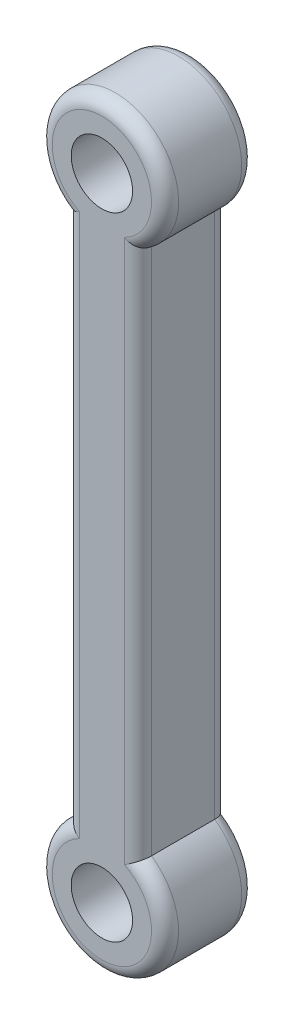
ISO-10303-21;
HEADER;
FILE_DESCRIPTION(('STEP AP214'),'2;1');
FILE_NAME('part.step','',(''),(''),'','','');
FILE_SCHEMA(('AUTOMOTIVE_DESIGN { 1 0 10303 214 1 1 1 1 }'));
ENDSEC;
DATA;
#1=APPLICATION_CONTEXT('core data for automotive mechanical design processes');
#2=APPLICATION_PROTOCOL_DEFINITION('international standard','automotive_design',2000,#1);
#3=PRODUCT_CONTEXT('',#1,'mechanical');
#4=PRODUCT('Part','Part','',(#3));
#5=PRODUCT_RELATED_PRODUCT_CATEGORY('part','',(#4));
#6=PRODUCT_DEFINITION_FORMATION('','',#4);
#7=PRODUCT_DEFINITION_CONTEXT('part definition',#1,'design');
#8=PRODUCT_DEFINITION('design','',#6,#7);
#9=PRODUCT_DEFINITION_SHAPE('','',#8);
#10=(LENGTH_UNIT() NAMED_UNIT(*) SI_UNIT(.MILLI.,.METRE.));
#11=(NAMED_UNIT(*) PLANE_ANGLE_UNIT() SI_UNIT($,.RADIAN.));
#12=(NAMED_UNIT(*) SI_UNIT($,.STERADIAN.) SOLID_ANGLE_UNIT());
#13=UNCERTAINTY_MEASURE_WITH_UNIT(LENGTH_MEASURE(1.E-05),#10,'distance_accuracy_value','');
#14=(GEOMETRIC_REPRESENTATION_CONTEXT(3) GLOBAL_UNCERTAINTY_ASSIGNED_CONTEXT((#13)) GLOBAL_UNIT_ASSIGNED_CONTEXT((#10,
#11,#12)) REPRESENTATION_CONTEXT('',''));
#15=CARTESIAN_POINT('',(0.,0.,0.));
#16=DIRECTION('',(0.,0.,1.));
#17=DIRECTION('',(1.,0.,0.));
#18=AXIS2_PLACEMENT_3D('',#15,#16,#17);
#19=CARTESIAN_POINT('',(0.,17.5,5.));
#20=DIRECTION('',(0.,0.,1.));
#21=DIRECTION('',(1.,0.,0.));
#22=AXIS2_PLACEMENT_3D('',#19,#20,#21);
#23=PLANE('',#22);
#24=CARTESIAN_POINT('',(0.,17.5,5.));
#25=DIRECTION('',(0.,0.,1.));
#26=DIRECTION('',(1.,0.,0.));
#27=AXIS2_PLACEMENT_3D('',#24,#25,#26);
#28=CIRCLE('',#27,2.75);
#29=CARTESIAN_POINT('',(1.25,15.0505102572168,5.));
#30=VERTEX_POINT('',#29);
#31=CARTESIAN_POINT('',(-1.25,15.0505102572168,5.));
#32=VERTEX_POINT('',#31);
#33=EDGE_CURVE('E65',#30,#32,#28,.T.);
#34=ORIENTED_EDGE('',*,*,#33,.T.);
#35=DIRECTION('',(0.,-1.,0.));
#36=VECTOR('',#35,1.);
#37=CARTESIAN_POINT('',(-1.25,-14.627718676731,5.));
#38=LINE('',#37,#36);
#39=CARTESIAN_POINT('',(-1.25,-15.0505102572168,5.));
#40=VERTEX_POINT('',#39);
#41=EDGE_CURVE('E11',#32,#40,#38,.T.);
#42=ORIENTED_EDGE('',*,*,#41,.T.);
#43=CARTESIAN_POINT('',(0.,-17.5,5.));
#44=DIRECTION('',(0.,0.,1.));
#45=DIRECTION('',(1.,0.,0.));
#46=AXIS2_PLACEMENT_3D('',#43,#44,#45);
#47=CIRCLE('',#46,2.75);
#48=CARTESIAN_POINT('',(1.25,-15.0505102572168,5.));
#49=VERTEX_POINT('',#48);
#50=EDGE_CURVE('E54',#40,#49,#47,.T.);
#51=ORIENTED_EDGE('',*,*,#50,.T.);
#52=DIRECTION('',(0.,1.,0.));
#53=VECTOR('',#52,1.);
#54=CARTESIAN_POINT('',(1.25,14.627718676731,5.));
#55=LINE('',#54,#53);
#56=EDGE_CURVE('E307',#49,#30,#55,.T.);
#57=ORIENTED_EDGE('',*,*,#56,.T.);
#58=EDGE_LOOP('',(#34,#42,#51,#57));
#59=FACE_BOUND('',#58,.T.);
#60=CARTESIAN_POINT('',(0.,-17.5,5.));
#61=DIRECTION('',(0.,0.,1.));
#62=DIRECTION('',(1.,0.,0.));
#63=AXIS2_PLACEMENT_3D('',#60,#61,#62);
#64=CIRCLE('',#63,1.7);
#65=CARTESIAN_POINT('',(1.7,-17.5,5.));
#66=VERTEX_POINT('',#65);
#67=EDGE_CURVE('E263',#66,#66,#64,.T.);
#68=ORIENTED_EDGE('',*,*,#67,.F.);
#69=EDGE_LOOP('',(#68));
#70=FACE_BOUND('',#69,.T.);
#71=CARTESIAN_POINT('',(0.,17.5,5.));
#72=DIRECTION('',(0.,0.,1.));
#73=DIRECTION('',(1.,0.,0.));
#74=AXIS2_PLACEMENT_3D('',#71,#72,#73);
#75=CIRCLE('',#74,1.7);
#76=CARTESIAN_POINT('',(1.69999999999999,17.5,5.));
#77=VERTEX_POINT('',#76);
#78=EDGE_CURVE('E253',#77,#77,#75,.T.);
#79=ORIENTED_EDGE('',*,*,#78,.F.);
#80=EDGE_LOOP('',(#79));
#81=FACE_BOUND('',#80,.T.);
#82=ADVANCED_FACE('F39',(#59,#70,#81),#23,.T.);
#83=CARTESIAN_POINT('',(0.,17.5,0.));
#84=DIRECTION('',(0.,0.,1.));
#85=DIRECTION('',(1.,0.,0.));
#86=AXIS2_PLACEMENT_3D('',#83,#84,#85);
#87=PLANE('',#86);
#88=DIRECTION('',(0.,-1.,0.));
#89=VECTOR('',#88,1.);
#90=CARTESIAN_POINT('',(-1.25,17.5,0.));
#91=LINE('',#90,#89);
#92=CARTESIAN_POINT('',(-1.25,-15.0505102572168,0.));
#93=VERTEX_POINT('',#92);
#94=CARTESIAN_POINT('',(-1.25,15.0505102572168,0.));
#95=VERTEX_POINT('',#94);
#96=EDGE_CURVE('E287',#93,#95,#91,.F.);
#97=ORIENTED_EDGE('',*,*,#96,.T.);
#98=CARTESIAN_POINT('',(0.,17.5,0.));
#99=DIRECTION('',(0.,0.,1.));
#100=DIRECTION('',(1.,0.,0.));
#101=AXIS2_PLACEMENT_3D('',#98,#99,#100);
#102=CIRCLE('',#101,2.75);
#103=CARTESIAN_POINT('',(1.25,15.0505102572168,0.));
#104=VERTEX_POINT('',#103);
#105=EDGE_CURVE('E122',#95,#104,#102,.F.);
#106=ORIENTED_EDGE('',*,*,#105,.T.);
#107=DIRECTION('',(0.,1.,0.));
#108=VECTOR('',#107,1.);
#109=CARTESIAN_POINT('',(1.25,17.5,0.));
#110=LINE('',#109,#108);
#111=CARTESIAN_POINT('',(1.25,-15.0505102572168,0.));
#112=VERTEX_POINT('',#111);
#113=EDGE_CURVE('E284',#104,#112,#110,.F.);
#114=ORIENTED_EDGE('',*,*,#113,.T.);
#115=CARTESIAN_POINT('',(0.,-17.5,0.));
#116=DIRECTION('',(0.,0.,1.));
#117=DIRECTION('',(1.,0.,0.));
#118=AXIS2_PLACEMENT_3D('',#115,#116,#117);
#119=CIRCLE('',#118,2.75);
#120=EDGE_CURVE('E281',#112,#93,#119,.F.);
#121=ORIENTED_EDGE('',*,*,#120,.T.);
#122=EDGE_LOOP('',(#97,#106,#114,#121));
#123=FACE_BOUND('',#122,.T.);
#124=CARTESIAN_POINT('',(0.,-17.5,0.));
#125=DIRECTION('',(0.,0.,1.));
#126=DIRECTION('',(1.,0.,0.));
#127=AXIS2_PLACEMENT_3D('',#124,#125,#126);
#128=CIRCLE('',#127,1.7);
#129=CARTESIAN_POINT('',(1.7,-17.5,0.));
#130=VERTEX_POINT('',#129);
#131=EDGE_CURVE('E260',#130,#130,#128,.T.);
#132=ORIENTED_EDGE('',*,*,#131,.T.);
#133=EDGE_LOOP('',(#132));
#134=FACE_BOUND('',#133,.T.);
#135=CARTESIAN_POINT('',(0.,17.5,0.));
#136=DIRECTION('',(0.,0.,1.));
#137=DIRECTION('',(1.,0.,0.));
#138=AXIS2_PLACEMENT_3D('',#135,#136,#137);
#139=CIRCLE('',#138,1.7);
#140=CARTESIAN_POINT('',(1.69999999999999,17.5,0.));
#141=VERTEX_POINT('',#140);
#142=EDGE_CURVE('E190',#141,#141,#139,.T.);
#143=ORIENTED_EDGE('',*,*,#142,.T.);
#144=EDGE_LOOP('',(#143));
#145=FACE_BOUND('',#144,.T.);
#146=ADVANCED_FACE('F223',(#123,#134,#145),#87,.F.);
#147=CARTESIAN_POINT('',(0.,17.5,5.));
#148=DIRECTION('',(0.,0.,-1.));
#149=DIRECTION('',(-1.,0.,0.));
#150=AXIS2_PLACEMENT_3D('',#147,#148,#149);
#151=CYLINDRICAL_SURFACE('',#150,3.5);
#152=DIRECTION('',(0.,0.,-1.));
#153=VECTOR('',#152,1.);
#154=CARTESIAN_POINT('',(2.,14.627718676731,5.));
#155=LINE('',#154,#153);
#156=CARTESIAN_POINT('',(2.,14.627718676731,4.25));
#157=VERTEX_POINT('',#156);
#158=CARTESIAN_POINT('',(2.,14.627718676731,0.75));
#159=VERTEX_POINT('',#158);
#160=EDGE_CURVE('E267',#157,#159,#155,.T.);
#161=ORIENTED_EDGE('',*,*,#160,.T.);
#162=CARTESIAN_POINT('',(0.,17.5,0.75));
#163=DIRECTION('',(0.,0.,1.));
#164=DIRECTION('',(1.,0.,0.));
#165=AXIS2_PLACEMENT_3D('',#162,#163,#164);
#166=CIRCLE('',#165,3.5);
#167=CARTESIAN_POINT('',(-2.,14.627718676731,0.75));
#168=VERTEX_POINT('',#167);
#169=EDGE_CURVE('E132',#159,#168,#166,.T.);
#170=ORIENTED_EDGE('',*,*,#169,.T.);
#171=DIRECTION('',(0.,0.,-1.));
#172=VECTOR('',#171,1.);
#173=CARTESIAN_POINT('',(-2.,14.627718676731,5.));
#174=LINE('',#173,#172);
#175=CARTESIAN_POINT('',(-2.,14.627718676731,4.25));
#176=VERTEX_POINT('',#175);
#177=EDGE_CURVE('E114',#176,#168,#174,.T.);
#178=ORIENTED_EDGE('',*,*,#177,.F.);
#179=CARTESIAN_POINT('',(0.,17.5,4.25));
#180=DIRECTION('',(0.,0.,1.));
#181=DIRECTION('',(1.,0.,0.));
#182=AXIS2_PLACEMENT_3D('',#179,#180,#181);
#183=CIRCLE('',#182,3.5);
#184=EDGE_CURVE('E129',#176,#157,#183,.F.);
#185=ORIENTED_EDGE('',*,*,#184,.T.);
#186=EDGE_LOOP('',(#161,#170,#178,#185));
#187=FACE_BOUND('',#186,.T.);
#188=ADVANCED_FACE('F128',(#187),#151,.T.);
#189=CARTESIAN_POINT('',(-2.,-14.627718676731,5.));
#190=DIRECTION('',(1.,0.,0.));
#191=DIRECTION('',(0.,0.,-1.));
#192=AXIS2_PLACEMENT_3D('',#189,#190,#191);
#193=PLANE('',#192);
#194=ORIENTED_EDGE('',*,*,#177,.T.);
#195=DIRECTION('',(0.,-1.,0.));
#196=VECTOR('',#195,1.);
#197=CARTESIAN_POINT('',(-2.,-14.627718676731,0.75));
#198=LINE('',#197,#196);
#199=CARTESIAN_POINT('',(-2.,-14.627718676731,0.75));
#200=VERTEX_POINT('',#199);
#201=EDGE_CURVE('E121',#168,#200,#198,.T.);
#202=ORIENTED_EDGE('',*,*,#201,.T.);
#203=DIRECTION('',(0.,0.,-1.));
#204=VECTOR('',#203,1.);
#205=CARTESIAN_POINT('',(-2.,-14.627718676731,5.));
#206=LINE('',#205,#204);
#207=CARTESIAN_POINT('',(-2.,-14.627718676731,4.25));
#208=VERTEX_POINT('',#207);
#209=EDGE_CURVE('E116',#208,#200,#206,.T.);
#210=ORIENTED_EDGE('',*,*,#209,.F.);
#211=DIRECTION('',(0.,-1.,0.));
#212=VECTOR('',#211,1.);
#213=CARTESIAN_POINT('',(-2.,14.627718676731,4.25));
#214=LINE('',#213,#212);
#215=EDGE_CURVE('E111',#208,#176,#214,.F.);
#216=ORIENTED_EDGE('',*,*,#215,.T.);
#217=EDGE_LOOP('',(#194,#202,#210,#216));
#218=FACE_BOUND('',#217,.T.);
#219=ADVANCED_FACE('F113',(#218),#193,.F.);
#220=CARTESIAN_POINT('',(0.,-17.5,5.));
#221=DIRECTION('',(0.,0.,-1.));
#222=DIRECTION('',(-1.,0.,0.));
#223=AXIS2_PLACEMENT_3D('',#220,#221,#222);
#224=CYLINDRICAL_SURFACE('',#223,3.5);
#225=ORIENTED_EDGE('',*,*,#209,.T.);
#226=CARTESIAN_POINT('',(0.,-17.5,0.75));
#227=DIRECTION('',(0.,0.,1.));
#228=DIRECTION('',(1.,0.,0.));
#229=AXIS2_PLACEMENT_3D('',#226,#227,#228);
#230=CIRCLE('',#229,3.5);
#231=CARTESIAN_POINT('',(2.,-14.627718676731,0.75));
#232=VERTEX_POINT('',#231);
#233=EDGE_CURVE('E304',#200,#232,#230,.T.);
#234=ORIENTED_EDGE('',*,*,#233,.T.);
#235=DIRECTION('',(0.,0.,-1.));
#236=VECTOR('',#235,1.);
#237=CARTESIAN_POINT('',(2.,-14.627718676731,5.));
#238=LINE('',#237,#236);
#239=CARTESIAN_POINT('',(2.,-14.627718676731,4.25));
#240=VERTEX_POINT('',#239);
#241=EDGE_CURVE('E273',#240,#232,#238,.T.);
#242=ORIENTED_EDGE('',*,*,#241,.F.);
#243=CARTESIAN_POINT('',(0.,-17.5,4.25));
#244=DIRECTION('',(0.,0.,1.));
#245=DIRECTION('',(1.,0.,0.));
#246=AXIS2_PLACEMENT_3D('',#243,#244,#245);
#247=CIRCLE('',#246,3.5);
#248=EDGE_CURVE('E301',#240,#208,#247,.F.);
#249=ORIENTED_EDGE('',*,*,#248,.T.);
#250=EDGE_LOOP('',(#225,#234,#242,#249));
#251=FACE_BOUND('',#250,.T.);
#252=ADVANCED_FACE('F226',(#251),#224,.T.);
#253=CARTESIAN_POINT('',(2.,-14.627718676731,5.));
#254=DIRECTION('',(-1.,0.,0.));
#255=DIRECTION('',(0.,0.,1.));
#256=AXIS2_PLACEMENT_3D('',#253,#254,#255);
#257=PLANE('',#256);
#258=ORIENTED_EDGE('',*,*,#241,.T.);
#259=DIRECTION('',(0.,1.,0.));
#260=VECTOR('',#259,1.);
#261=CARTESIAN_POINT('',(2.,-14.627718676731,0.75));
#262=LINE('',#261,#260);
#263=EDGE_CURVE('E298',#232,#159,#262,.T.);
#264=ORIENTED_EDGE('',*,*,#263,.T.);
#265=ORIENTED_EDGE('',*,*,#160,.F.);
#266=DIRECTION('',(0.,1.,0.));
#267=VECTOR('',#266,1.);
#268=CARTESIAN_POINT('',(2.,-14.627718676731,4.25));
#269=LINE('',#268,#267);
#270=EDGE_CURVE('E295',#157,#240,#269,.F.);
#271=ORIENTED_EDGE('',*,*,#270,.T.);
#272=EDGE_LOOP('',(#258,#264,#265,#271));
#273=FACE_BOUND('',#272,.T.);
#274=ADVANCED_FACE('F229',(#273),#257,.F.);
#275=CARTESIAN_POINT('',(0.,-17.5,5.));
#276=DIRECTION('',(0.,0.,-1.));
#277=DIRECTION('',(-1.,0.,0.));
#278=AXIS2_PLACEMENT_3D('',#275,#276,#277);
#279=CYLINDRICAL_SURFACE('',#278,1.7);
#280=ORIENTED_EDGE('',*,*,#67,.T.);
#281=EDGE_LOOP('',(#280));
#282=FACE_BOUND('',#281,.T.);
#283=ORIENTED_EDGE('',*,*,#131,.F.);
#284=EDGE_LOOP('',(#283));
#285=FACE_BOUND('',#284,.T.);
#286=ADVANCED_FACE('F233',(#282,#285),#279,.F.);
#287=CARTESIAN_POINT('',(0.,17.5,5.));
#288=DIRECTION('',(0.,0.,-1.));
#289=DIRECTION('',(-1.,0.,0.));
#290=AXIS2_PLACEMENT_3D('',#287,#288,#289);
#291=CYLINDRICAL_SURFACE('',#290,1.7);
#292=ORIENTED_EDGE('',*,*,#78,.T.);
#293=EDGE_LOOP('',(#292));
#294=FACE_BOUND('',#293,.T.);
#295=ORIENTED_EDGE('',*,*,#142,.F.);
#296=EDGE_LOOP('',(#295));
#297=FACE_BOUND('',#296,.T.);
#298=ADVANCED_FACE('F242',(#294,#297),#291,.F.);
#299=CARTESIAN_POINT('',(0.,-17.5,0.75));
#300=DIRECTION('',(0.,0.,1.));
#301=DIRECTION('',(1.,0.,0.));
#302=AXIS2_PLACEMENT_3D('',#299,#300,#301);
#303=TOROIDAL_SURFACE('',#302,2.75,0.75);
#304=CARTESIAN_POINT('',(-2.,-14.627718676731,0.75));
#305=CARTESIAN_POINT('',(-2.00000095325139,-14.6277184380373,0.730675526344664));
#306=CARTESIAN_POINT('',(-1.9992525688487,-14.6281089826292,0.711360936222173));
#307=CARTESIAN_POINT('',(-1.99627424982253,-14.6296648887274,0.672882704881055));
#308=CARTESIAN_POINT('',(-1.99404470038907,-14.6308300487882,0.65371902572743));
#309=CARTESIAN_POINT('',(-1.9851853415741,-14.6354640650265,0.596802648427952));
#310=CARTESIAN_POINT('',(-1.97638447728872,-14.6400716010906,0.55945312347999));
#311=CARTESIAN_POINT('',(-1.95340221103497,-14.6521512369574,0.486994207855817));
#312=CARTESIAN_POINT('',(-1.9392236720455,-14.6596218125506,0.451883636798332));
#313=CARTESIAN_POINT('',(-1.90608780115928,-14.6771751313508,0.384688114777172));
#314=CARTESIAN_POINT('',(-1.88712766361704,-14.6872594082671,0.352604955415009));
#315=CARTESIAN_POINT('',(-1.84429220721255,-14.7101947947676,0.290886192530706));
#316=CARTESIAN_POINT('',(-1.82024732758605,-14.7231423410526,0.261404735108066));
#317=CARTESIAN_POINT('',(-1.76861818996254,-14.7511728049644,0.206911260304124));
#318=CARTESIAN_POINT('',(-1.74103304512401,-14.7662562577371,0.18190036657455));
#319=CARTESIAN_POINT('',(-1.68006819436873,-14.7999043802964,0.134212940683131));
#320=CARTESIAN_POINT('',(-1.64638422956725,-14.8186686626426,0.112067097720292));
#321=CARTESIAN_POINT('',(-1.57670265513905,-14.8579375600058,0.073723877566145));
#322=CARTESIAN_POINT('',(-1.54070289395295,-14.8784437992777,0.0575321287942939));
#323=CARTESIAN_POINT('',(-1.46344331662629,-14.9230100379807,0.0297209935896172));
#324=CARTESIAN_POINT('',(-1.42202995025201,-14.9472164873707,0.0187665914594678));
#325=CARTESIAN_POINT('',(-1.33865282455477,-14.9966885122841,0.00405890903843842));
#326=CARTESIAN_POINT('',(-1.29669025481339,-15.0219519973025,0.000292043517131759));
#327=CARTESIAN_POINT('',(-1.25329968550071,-15.0484902410092,5.43429847304771E-06));
#328=CARTESIAN_POINT('',(-1.25164965235718,-15.0495000505079,-9.07586938193818E-09));
#329=CARTESIAN_POINT('',(-1.25,-15.0505102572168,0.));
#330=B_SPLINE_CURVE_WITH_KNOTS('',3,(#304,#305,#306,#307,#308,#309,#310,#311,#312,#313,#314,
#315,#316,#317,#318,#319,#320,#321,#322,#323,#324,#325,#326,#327,#328,#329),.UNSPECIFIED.,.F.,
.F.,(4,2,2,2,2,2,2,2,2,2,2,2,4),(0.,0.0579356663711786,0.115856271956782,0.231189950300505,
0.346462313024938,0.461802470843834,0.581868497571108,0.701964659931731,0.834825964767603,
0.96781254279977,1.11486883078254,1.26164688989136,1.26745040204934),.UNSPECIFIED.);
#331=EDGE_CURVE('E191',#93,#200,#330,.F.);
#332=ORIENTED_EDGE('',*,*,#331,.F.);
#333=ORIENTED_EDGE('',*,*,#120,.F.);
#334=CARTESIAN_POINT('',(2.,-14.627718676731,0.75));
#335=CARTESIAN_POINT('',(2.00000095325139,-14.6277184380373,0.730675526344664));
#336=CARTESIAN_POINT('',(1.9992525688487,-14.6281089826292,0.711360936222173));
#337=CARTESIAN_POINT('',(1.99627424982253,-14.6296648887274,0.672882704881056));
#338=CARTESIAN_POINT('',(1.99404470038907,-14.6308300487882,0.65371902572743));
#339=CARTESIAN_POINT('',(1.9851853415741,-14.6354640650265,0.596802648427952));
#340=CARTESIAN_POINT('',(1.97638447728872,-14.6400716010906,0.559453123479991));
#341=CARTESIAN_POINT('',(1.95340221103497,-14.6521512369574,0.486994207855817));
#342=CARTESIAN_POINT('',(1.9392236720455,-14.6596218125506,0.451883636798333));
#343=CARTESIAN_POINT('',(1.90608780115928,-14.6771751313508,0.384688114777172));
#344=CARTESIAN_POINT('',(1.88712766361704,-14.6872594082671,0.352604955415009));
#345=CARTESIAN_POINT('',(1.84429220721255,-14.7101947947676,0.290886192530706));
#346=CARTESIAN_POINT('',(1.82024732758605,-14.7231423410526,0.261404735108067));
#347=CARTESIAN_POINT('',(1.76861818996254,-14.7511728049644,0.206911260304125));
#348=CARTESIAN_POINT('',(1.74103304512401,-14.7662562577371,0.181900366574551));
#349=CARTESIAN_POINT('',(1.68006819436873,-14.7999043802964,0.134212940683132));
#350=CARTESIAN_POINT('',(1.64638422956725,-14.8186686626426,0.112067097720293));
#351=CARTESIAN_POINT('',(1.57670265513905,-14.8579375600058,0.0737238775661453));
#352=CARTESIAN_POINT('',(1.54070289395296,-14.8784437992777,0.0575321287942943));
#353=CARTESIAN_POINT('',(1.46344331662629,-14.9230100379806,0.0297209935896177));
#354=CARTESIAN_POINT('',(1.42202995025202,-14.9472164873707,0.0187665914594682));
#355=CARTESIAN_POINT('',(1.33865282455477,-14.9966885122841,0.0040589090384384));
#356=CARTESIAN_POINT('',(1.29669025481338,-15.0219519973025,0.000292043517131481));
#357=CARTESIAN_POINT('',(1.25329968550071,-15.0484902410092,5.43429847302378E-06));
#358=CARTESIAN_POINT('',(1.25164965235718,-15.0495000505079,-9.07586939531536E-09));
#359=CARTESIAN_POINT('',(1.25,-15.0505102572168,0.));
#360=B_SPLINE_CURVE_WITH_KNOTS('',3,(#334,#335,#336,#337,#338,#339,#340,#341,#342,#343,#344,
#345,#346,#347,#348,#349,#350,#351,#352,#353,#354,#355,#356,#357,#358,#359),.UNSPECIFIED.,.F.,
.F.,(4,2,2,2,2,2,2,2,2,2,2,2,4),(0.,0.0579356663711784,0.115856271956782,0.231189950300505,
0.346462313024938,0.461802470843834,0.581868497571108,0.701964659931731,0.834825964767601,
0.96781254279977,1.11486883078254,1.26164688989136,1.26745040204934),.UNSPECIFIED.);
#361=EDGE_CURVE('E182',#232,#112,#360,.T.);
#362=ORIENTED_EDGE('',*,*,#361,.F.);
#363=ORIENTED_EDGE('',*,*,#233,.F.);
#364=EDGE_LOOP('',(#332,#333,#362,#363));
#365=FACE_BOUND('',#364,.T.);
#366=ADVANCED_FACE('F171',(#365),#303,.T.);
#367=CARTESIAN_POINT('',(1.25,-14.627718676731,0.75));
#368=DIRECTION('',(0.,1.,0.));
#369=DIRECTION('',(0.,0.,1.));
#370=AXIS2_PLACEMENT_3D('',#367,#368,#369);
#371=CYLINDRICAL_SURFACE('',#370,0.75);
#372=ORIENTED_EDGE('',*,*,#361,.T.);
#373=ORIENTED_EDGE('',*,*,#113,.F.);
#374=CARTESIAN_POINT('',(2.,14.627718676731,0.75));
#375=CARTESIAN_POINT('',(2.00000095325139,14.6277184380373,0.730675526344664));
#376=CARTESIAN_POINT('',(1.9992525688487,14.6281089826292,0.711360936222173));
#377=CARTESIAN_POINT('',(1.99627424982253,14.6296648887274,0.672882704881055));
#378=CARTESIAN_POINT('',(1.99404470038907,14.6308300487882,0.65371902572743));
#379=CARTESIAN_POINT('',(1.9851853415741,14.6354640650265,0.596802648427952));
#380=CARTESIAN_POINT('',(1.97638447728872,14.6400716010906,0.55945312347999));
#381=CARTESIAN_POINT('',(1.95340221103497,14.6521512369574,0.486994207855817));
#382=CARTESIAN_POINT('',(1.9392236720455,14.6596218125506,0.451883636798332));
#383=CARTESIAN_POINT('',(1.90608780115928,14.6771751313508,0.384688114777172));
#384=CARTESIAN_POINT('',(1.88712766361704,14.6872594082671,0.352604955415009));
#385=CARTESIAN_POINT('',(1.84429220721255,14.7101947947676,0.290886192530706));
#386=CARTESIAN_POINT('',(1.82024732758605,14.7231423410526,0.261404735108066));
#387=CARTESIAN_POINT('',(1.76861818996254,14.7511728049644,0.206911260304124));
#388=CARTESIAN_POINT('',(1.74103304512401,14.7662562577371,0.18190036657455));
#389=CARTESIAN_POINT('',(1.68006819436873,14.7999043802964,0.134212940683132));
#390=CARTESIAN_POINT('',(1.64638422956725,14.8186686626426,0.112067097720293));
#391=CARTESIAN_POINT('',(1.57670265513904,14.8579375600058,0.073723877566145));
#392=CARTESIAN_POINT('',(1.54070289395295,14.8784437992777,0.0575321287942939));
#393=CARTESIAN_POINT('',(1.46344331662629,14.9230100379807,0.0297209935896173));
#394=CARTESIAN_POINT('',(1.42202995025203,14.9472164873708,0.018766591459468));
#395=CARTESIAN_POINT('',(1.33865282455475,14.9966885122841,0.00405890903843832));
#396=CARTESIAN_POINT('',(1.29669025481334,15.0219519973024,0.000292043517131219));
#397=CARTESIAN_POINT('',(1.2532996855007,15.0484902410092,5.43429847300519E-06));
#398=CARTESIAN_POINT('',(1.25164965235718,15.0495000505079,-9.07586940405784E-09));
#399=CARTESIAN_POINT('',(1.25,15.0505102572168,0.));
#400=B_SPLINE_CURVE_WITH_KNOTS('',3,(#374,#375,#376,#377,#378,#379,#380,#381,#382,#383,#384,
#385,#386,#387,#388,#389,#390,#391,#392,#393,#394,#395,#396,#397,#398,#399),.UNSPECIFIED.,.F.,
.F.,(4,2,2,2,2,2,2,2,2,2,2,2,4),(0.,0.0579356663711786,0.115856271956782,0.231189950300505,
0.346462313024938,0.461802470843834,0.581868497571108,0.701964659931731,0.834825964767602,
0.96781254279977,1.11486883078254,1.26164688989136,1.26745040204934),.UNSPECIFIED.);
#401=EDGE_CURVE('E147',#159,#104,#400,.T.);
#402=ORIENTED_EDGE('',*,*,#401,.F.);
#403=ORIENTED_EDGE('',*,*,#263,.F.);
#404=EDGE_LOOP('',(#372,#373,#402,#403));
#405=FACE_BOUND('',#404,.T.);
#406=ADVANCED_FACE('F198',(#405),#371,.T.);
#407=CARTESIAN_POINT('',(-1.25,-14.627718676731,0.75));
#408=DIRECTION('',(0.,-1.,0.));
#409=DIRECTION('',(0.,0.,-1.));
#410=AXIS2_PLACEMENT_3D('',#407,#408,#409);
#411=CYLINDRICAL_SURFACE('',#410,0.75);
#412=ORIENTED_EDGE('',*,*,#331,.T.);
#413=ORIENTED_EDGE('',*,*,#201,.F.);
#414=CARTESIAN_POINT('',(-2.,14.627718676731,0.75));
#415=CARTESIAN_POINT('',(-2.00000095325139,14.6277184380373,0.730675526344664));
#416=CARTESIAN_POINT('',(-1.9992525688487,14.6281089826292,0.711360936222173));
#417=CARTESIAN_POINT('',(-1.99627424982253,14.6296648887274,0.672882704881055));
#418=CARTESIAN_POINT('',(-1.99404470038907,14.6308300487882,0.65371902572743));
#419=CARTESIAN_POINT('',(-1.9851853415741,14.6354640650265,0.596802648427952));
#420=CARTESIAN_POINT('',(-1.97638447728872,14.6400716010906,0.559453123479991));
#421=CARTESIAN_POINT('',(-1.95340221103497,14.6521512369574,0.486994207855817));
#422=CARTESIAN_POINT('',(-1.9392236720455,14.6596218125506,0.451883636798333));
#423=CARTESIAN_POINT('',(-1.90608780115928,14.6771751313508,0.384688114777172));
#424=CARTESIAN_POINT('',(-1.88712766361704,14.6872594082671,0.352604955415009));
#425=CARTESIAN_POINT('',(-1.84429220721255,14.7101947947675,0.290886192530706));
#426=CARTESIAN_POINT('',(-1.82024732758605,14.7231423410526,0.261404735108067));
#427=CARTESIAN_POINT('',(-1.76861818996254,14.7511728049644,0.206911260304124));
#428=CARTESIAN_POINT('',(-1.74103304512401,14.7662562577371,0.18190036657455));
#429=CARTESIAN_POINT('',(-1.68006819436873,14.7999043802964,0.134212940683131));
#430=CARTESIAN_POINT('',(-1.64638422956725,14.8186686626426,0.112067097720292));
#431=CARTESIAN_POINT('',(-1.57670265513904,14.8579375600058,0.0737238775661451));
#432=CARTESIAN_POINT('',(-1.54070289395295,14.8784437992777,0.0575321287942941));
#433=CARTESIAN_POINT('',(-1.46344331662629,14.9230100379806,0.0297209935896174));
#434=CARTESIAN_POINT('',(-1.42202995025202,14.9472164873707,0.0187665914594679));
#435=CARTESIAN_POINT('',(-1.33865282455476,14.9966885122841,0.00405890903843827));
#436=CARTESIAN_POINT('',(-1.29669025481336,15.0219519973025,0.000292043517131478));
#437=CARTESIAN_POINT('',(-1.25329968550071,15.0484902410092,5.43429847302699E-06));
#438=CARTESIAN_POINT('',(-1.25164965235718,15.0495000505079,-9.07586939219915E-09));
#439=CARTESIAN_POINT('',(-1.25,15.0505102572168,0.));
#440=B_SPLINE_CURVE_WITH_KNOTS('',3,(#414,#415,#416,#417,#418,#419,#420,#421,#422,#423,#424,
#425,#426,#427,#428,#429,#430,#431,#432,#433,#434,#435,#436,#437,#438,#439),.UNSPECIFIED.,.F.,
.F.,(4,2,2,2,2,2,2,2,2,2,2,2,4),(0.,0.0579356663711786,0.115856271956782,0.231189950300504,
0.346462313024937,0.461802470843834,0.581868497571109,0.701964659931731,0.834825964767603,
0.96781254279977,1.11486883078254,1.26164688989136,1.26745040204934),.UNSPECIFIED.);
#441=EDGE_CURVE('E144',#95,#168,#440,.F.);
#442=ORIENTED_EDGE('',*,*,#441,.F.);
#443=ORIENTED_EDGE('',*,*,#96,.F.);
#444=EDGE_LOOP('',(#412,#413,#442,#443));
#445=FACE_BOUND('',#444,.T.);
#446=ADVANCED_FACE('F201',(#445),#411,.T.);
#447=CARTESIAN_POINT('',(0.,17.5,0.75));
#448=DIRECTION('',(0.,0.,1.));
#449=DIRECTION('',(1.,0.,0.));
#450=AXIS2_PLACEMENT_3D('',#447,#448,#449);
#451=TOROIDAL_SURFACE('',#450,2.75,0.75);
#452=ORIENTED_EDGE('',*,*,#401,.T.);
#453=ORIENTED_EDGE('',*,*,#105,.F.);
#454=ORIENTED_EDGE('',*,*,#441,.T.);
#455=ORIENTED_EDGE('',*,*,#169,.F.);
#456=EDGE_LOOP('',(#452,#453,#454,#455));
#457=FACE_BOUND('',#456,.T.);
#458=ADVANCED_FACE('F215',(#457),#451,.T.);
#459=CARTESIAN_POINT('',(0.,17.5,4.25));
#460=DIRECTION('',(0.,0.,1.));
#461=DIRECTION('',(1.,0.,0.));
#462=AXIS2_PLACEMENT_3D('',#459,#460,#461);
#463=TOROIDAL_SURFACE('',#462,2.75,0.75);
#464=CARTESIAN_POINT('',(2.,14.627718676731,4.25));
#465=CARTESIAN_POINT('',(2.00000095325139,14.6277184380373,4.26932447365534));
#466=CARTESIAN_POINT('',(1.9992525688487,14.6281089826292,4.28863906377783));
#467=CARTESIAN_POINT('',(1.99627424982253,14.6296648887274,4.32711729511894));
#468=CARTESIAN_POINT('',(1.99404470038907,14.6308300487882,4.34628097427257));
#469=CARTESIAN_POINT('',(1.9851853415741,14.6354640650265,4.40319735157205));
#470=CARTESIAN_POINT('',(1.97638447728872,14.6400716010906,4.44054687652001));
#471=CARTESIAN_POINT('',(1.95340221103497,14.6521512369574,4.51300579214418));
#472=CARTESIAN_POINT('',(1.9392236720455,14.6596218125506,4.54811636320167));
#473=CARTESIAN_POINT('',(1.90608780115928,14.6771751313508,4.61531188522283));
#474=CARTESIAN_POINT('',(1.88712766361704,14.6872594082671,4.64739504458499));
#475=CARTESIAN_POINT('',(1.84429220721255,14.7101947947676,4.70911380746929));
#476=CARTESIAN_POINT('',(1.82024732758605,14.7231423410526,4.73859526489193));
#477=CARTESIAN_POINT('',(1.76861818996254,14.7511728049644,4.79308873969588));
#478=CARTESIAN_POINT('',(1.74103304512401,14.7662562577371,4.81809963342545));
#479=CARTESIAN_POINT('',(1.68006819436873,14.7999043802964,4.86578705931687));
#480=CARTESIAN_POINT('',(1.64638422956725,14.8186686626426,4.88793290227971));
#481=CARTESIAN_POINT('',(1.57670265513904,14.8579375600058,4.92627612243386));
#482=CARTESIAN_POINT('',(1.54070289395295,14.8784437992777,4.94246787120571));
#483=CARTESIAN_POINT('',(1.46344331662629,14.9230100379807,4.97027900641038));
#484=CARTESIAN_POINT('',(1.42202995025202,14.9472164873708,4.98123340854053));
#485=CARTESIAN_POINT('',(1.33865282455476,14.9966885122841,4.99594109096156));
#486=CARTESIAN_POINT('',(1.29669025481336,15.0219519973025,4.99970795648287));
#487=CARTESIAN_POINT('',(1.25329968550071,15.0484902410092,4.99999456570153));
#488=CARTESIAN_POINT('',(1.25164965235718,15.0495000505079,5.00000000907587));
#489=CARTESIAN_POINT('',(1.25,15.0505102572168,5.));
#490=B_SPLINE_CURVE_WITH_KNOTS('',3,(#464,#465,#466,#467,#468,#469,#470,#471,#472,#473,#474,
#475,#476,#477,#478,#479,#480,#481,#482,#483,#484,#485,#486,#487,#488,#489),.UNSPECIFIED.,.F.,
.F.,(4,2,2,2,2,2,2,2,2,2,2,2,4),(0.,0.0579356663711781,0.115856271956782,0.231189950300505,
0.346462313024937,0.461802470843834,0.581868497571109,0.701964659931732,0.834825964767603,
0.967812542799772,1.11486883078254,1.26164688989136,1.26745040204934),.UNSPECIFIED.);
#491=EDGE_CURVE('E138',#157,#30,#490,.T.);
#492=ORIENTED_EDGE('',*,*,#491,.F.);
#493=ORIENTED_EDGE('',*,*,#184,.F.);
#494=CARTESIAN_POINT('',(-2.,14.627718676731,4.25));
#495=CARTESIAN_POINT('',(-2.00000095325139,14.6277184380373,4.26932447365534));
#496=CARTESIAN_POINT('',(-1.9992525688487,14.6281089826292,4.28863906377783));
#497=CARTESIAN_POINT('',(-1.99627424982253,14.6296648887274,4.32711729511894));
#498=CARTESIAN_POINT('',(-1.99404470038907,14.6308300487882,4.34628097427257));
#499=CARTESIAN_POINT('',(-1.9851853415741,14.6354640650265,4.40319735157205));
#500=CARTESIAN_POINT('',(-1.97638447728872,14.6400716010906,4.44054687652001));
#501=CARTESIAN_POINT('',(-1.95340221103497,14.6521512369574,4.51300579214418));
#502=CARTESIAN_POINT('',(-1.9392236720455,14.6596218125506,4.54811636320167));
#503=CARTESIAN_POINT('',(-1.90608780115928,14.6771751313508,4.61531188522283));
#504=CARTESIAN_POINT('',(-1.88712766361704,14.6872594082671,4.64739504458499));
#505=CARTESIAN_POINT('',(-1.84429220721255,14.7101947947675,4.70911380746929));
#506=CARTESIAN_POINT('',(-1.82024732758605,14.7231423410526,4.73859526489193));
#507=CARTESIAN_POINT('',(-1.76861818996254,14.7511728049644,4.79308873969588));
#508=CARTESIAN_POINT('',(-1.74103304512401,14.7662562577371,4.81809963342545));
#509=CARTESIAN_POINT('',(-1.68006819436873,14.7999043802964,4.86578705931687));
#510=CARTESIAN_POINT('',(-1.64638422956725,14.8186686626426,4.88793290227971));
#511=CARTESIAN_POINT('',(-1.57670265513904,14.8579375600058,4.92627612243385));
#512=CARTESIAN_POINT('',(-1.54070289395295,14.8784437992777,4.94246787120571));
#513=CARTESIAN_POINT('',(-1.46344331662629,14.9230100379807,4.97027900641038));
#514=CARTESIAN_POINT('',(-1.42202995025203,14.9472164873708,4.98123340854053));
#515=CARTESIAN_POINT('',(-1.33865282455476,14.9966885122841,4.99594109096156));
#516=CARTESIAN_POINT('',(-1.29669025481334,15.0219519973024,4.99970795648287));
#517=CARTESIAN_POINT('',(-1.25329968550071,15.0484902410092,4.99999456570153));
#518=CARTESIAN_POINT('',(-1.25164965235718,15.0495000505079,5.00000000907587));
#519=CARTESIAN_POINT('',(-1.25,15.0505102572168,5.));
#520=B_SPLINE_CURVE_WITH_KNOTS('',3,(#494,#495,#496,#497,#498,#499,#500,#501,#502,#503,#504,
#505,#506,#507,#508,#509,#510,#511,#512,#513,#514,#515,#516,#517,#518,#519),.UNSPECIFIED.,.F.,
.F.,(4,2,2,2,2,2,2,2,2,2,2,2,4),(0.,0.057935666371179,0.115856271956783,0.231189950300505,
0.346462313024938,0.461802470843834,0.581868497571108,0.701964659931731,0.834825964767603,
0.96781254279977,1.11486883078254,1.26164688989136,1.26745040204934),.UNSPECIFIED.);
#521=EDGE_CURVE('E44',#32,#176,#520,.F.);
#522=ORIENTED_EDGE('',*,*,#521,.F.);
#523=ORIENTED_EDGE('',*,*,#33,.F.);
#524=EDGE_LOOP('',(#492,#493,#522,#523));
#525=FACE_BOUND('',#524,.T.);
#526=ADVANCED_FACE('F41',(#525),#463,.T.);
#527=CARTESIAN_POINT('',(-1.25,17.5,4.25));
#528=DIRECTION('',(0.,1.,0.));
#529=DIRECTION('',(0.,0.,1.));
#530=AXIS2_PLACEMENT_3D('',#527,#528,#529);
#531=CYLINDRICAL_SURFACE('',#530,0.75);
#532=ORIENTED_EDGE('',*,*,#521,.T.);
#533=ORIENTED_EDGE('',*,*,#215,.F.);
#534=CARTESIAN_POINT('',(-2.,-14.627718676731,4.25));
#535=CARTESIAN_POINT('',(-2.00000095325139,-14.6277184380373,4.26932447365534));
#536=CARTESIAN_POINT('',(-1.9992525688487,-14.6281089826292,4.28863906377783));
#537=CARTESIAN_POINT('',(-1.99627424982253,-14.6296648887274,4.32711729511894));
#538=CARTESIAN_POINT('',(-1.99404470038907,-14.6308300487882,4.34628097427257));
#539=CARTESIAN_POINT('',(-1.9851853415741,-14.6354640650265,4.40319735157205));
#540=CARTESIAN_POINT('',(-1.97638447728872,-14.6400716010906,4.44054687652001));
#541=CARTESIAN_POINT('',(-1.95340221103497,-14.6521512369574,4.51300579214418));
#542=CARTESIAN_POINT('',(-1.9392236720455,-14.6596218125506,4.54811636320167));
#543=CARTESIAN_POINT('',(-1.90608780115928,-14.6771751313508,4.61531188522283));
#544=CARTESIAN_POINT('',(-1.88712766361704,-14.6872594082671,4.64739504458499));
#545=CARTESIAN_POINT('',(-1.84429220721255,-14.7101947947676,4.70911380746929));
#546=CARTESIAN_POINT('',(-1.82024732758605,-14.7231423410526,4.73859526489193));
#547=CARTESIAN_POINT('',(-1.76861818996254,-14.7511728049644,4.79308873969588));
#548=CARTESIAN_POINT('',(-1.74103304512401,-14.7662562577371,4.81809963342545));
#549=CARTESIAN_POINT('',(-1.68006819436873,-14.7999043802964,4.86578705931687));
#550=CARTESIAN_POINT('',(-1.64638422956725,-14.8186686626426,4.88793290227971));
#551=CARTESIAN_POINT('',(-1.57670265513904,-14.8579375600058,4.92627612243386));
#552=CARTESIAN_POINT('',(-1.54070289395295,-14.8784437992777,4.94246787120571));
#553=CARTESIAN_POINT('',(-1.46344331662629,-14.9230100379807,4.97027900641038));
#554=CARTESIAN_POINT('',(-1.42202995025202,-14.9472164873708,4.98123340854053));
#555=CARTESIAN_POINT('',(-1.33865282455476,-14.9966885122841,4.99594109096156));
#556=CARTESIAN_POINT('',(-1.29669025481336,-15.0219519973025,4.99970795648287));
#557=CARTESIAN_POINT('',(-1.25329968550071,-15.0484902410092,4.99999456570153));
#558=CARTESIAN_POINT('',(-1.25164965235718,-15.0495000505079,5.00000000907587));
#559=CARTESIAN_POINT('',(-1.25,-15.0505102572168,5.));
#560=B_SPLINE_CURVE_WITH_KNOTS('',3,(#534,#535,#536,#537,#538,#539,#540,#541,#542,#543,#544,
#545,#546,#547,#548,#549,#550,#551,#552,#553,#554,#555,#556,#557,#558,#559),.UNSPECIFIED.,.F.,
.F.,(4,2,2,2,2,2,2,2,2,2,2,2,4),(0.,0.0579356663711781,0.115856271956783,0.231189950300505,
0.346462313024938,0.461802470843834,0.581868497571109,0.701964659931732,0.834825964767603,
0.967812542799772,1.11486883078254,1.26164688989136,1.26745040204934),.UNSPECIFIED.);
#561=EDGE_CURVE('E149',#40,#208,#560,.F.);
#562=ORIENTED_EDGE('',*,*,#561,.F.);
#563=ORIENTED_EDGE('',*,*,#41,.F.);
#564=EDGE_LOOP('',(#532,#533,#562,#563));
#565=FACE_BOUND('',#564,.T.);
#566=ADVANCED_FACE('F142',(#565),#531,.T.);
#567=CARTESIAN_POINT('',(1.25,17.5,4.25));
#568=DIRECTION('',(0.,-1.,0.));
#569=DIRECTION('',(0.,0.,-1.));
#570=AXIS2_PLACEMENT_3D('',#567,#568,#569);
#571=CYLINDRICAL_SURFACE('',#570,0.75);
#572=ORIENTED_EDGE('',*,*,#491,.T.);
#573=ORIENTED_EDGE('',*,*,#56,.F.);
#574=CARTESIAN_POINT('',(2.,-14.627718676731,4.25));
#575=CARTESIAN_POINT('',(2.00000095325139,-14.6277184380373,4.26932447365534));
#576=CARTESIAN_POINT('',(1.9992525688487,-14.6281089826292,4.28863906377783));
#577=CARTESIAN_POINT('',(1.99627424982253,-14.6296648887274,4.32711729511894));
#578=CARTESIAN_POINT('',(1.99404470038907,-14.6308300487882,4.34628097427257));
#579=CARTESIAN_POINT('',(1.9851853415741,-14.6354640650265,4.40319735157205));
#580=CARTESIAN_POINT('',(1.97638447728872,-14.6400716010906,4.44054687652001));
#581=CARTESIAN_POINT('',(1.95340221103497,-14.6521512369574,4.51300579214418));
#582=CARTESIAN_POINT('',(1.9392236720455,-14.6596218125506,4.54811636320167));
#583=CARTESIAN_POINT('',(1.90608780115928,-14.6771751313508,4.61531188522283));
#584=CARTESIAN_POINT('',(1.88712766361704,-14.6872594082671,4.64739504458499));
#585=CARTESIAN_POINT('',(1.84429220721255,-14.7101947947676,4.70911380746929));
#586=CARTESIAN_POINT('',(1.82024732758605,-14.7231423410526,4.73859526489193));
#587=CARTESIAN_POINT('',(1.76861818996254,-14.7511728049644,4.79308873969588));
#588=CARTESIAN_POINT('',(1.74103304512401,-14.7662562577371,4.81809963342545));
#589=CARTESIAN_POINT('',(1.68006819436873,-14.7999043802964,4.86578705931687));
#590=CARTESIAN_POINT('',(1.64638422956725,-14.8186686626426,4.88793290227971));
#591=CARTESIAN_POINT('',(1.57670265513904,-14.8579375600058,4.92627612243386));
#592=CARTESIAN_POINT('',(1.54070289395295,-14.8784437992777,4.94246787120571));
#593=CARTESIAN_POINT('',(1.46344331662629,-14.9230100379807,4.97027900641038));
#594=CARTESIAN_POINT('',(1.42202995025202,-14.9472164873708,4.98123340854053));
#595=CARTESIAN_POINT('',(1.33865282455475,-14.9966885122841,4.99594109096156));
#596=CARTESIAN_POINT('',(1.29669025481334,-15.0219519973024,4.99970795648287));
#597=CARTESIAN_POINT('',(1.2532996855007,-15.0484902410092,4.99999456570153));
#598=CARTESIAN_POINT('',(1.25164965235718,-15.0495000505079,5.00000000907587));
#599=CARTESIAN_POINT('',(1.25,-15.0505102572168,5.));
#600=B_SPLINE_CURVE_WITH_KNOTS('',3,(#574,#575,#576,#577,#578,#579,#580,#581,#582,#583,#584,
#585,#586,#587,#588,#589,#590,#591,#592,#593,#594,#595,#596,#597,#598,#599),.UNSPECIFIED.,.F.,
.F.,(4,2,2,2,2,2,2,2,2,2,2,2,4),(0.,0.0579356663711782,0.115856271956782,0.231189950300505,
0.346462313024939,0.461802470843835,0.581868497571109,0.701964659931731,0.834825964767604,
0.967812542799772,1.11486883078254,1.26164688989136,1.26745040204934),.UNSPECIFIED.);
#601=EDGE_CURVE('E153',#240,#49,#600,.T.);
#602=ORIENTED_EDGE('',*,*,#601,.F.);
#603=ORIENTED_EDGE('',*,*,#270,.F.);
#604=EDGE_LOOP('',(#572,#573,#602,#603));
#605=FACE_BOUND('',#604,.T.);
#606=ADVANCED_FACE('F166',(#605),#571,.T.);
#607=CARTESIAN_POINT('',(0.,-17.5,4.25));
#608=DIRECTION('',(0.,0.,1.));
#609=DIRECTION('',(1.,0.,0.));
#610=AXIS2_PLACEMENT_3D('',#607,#608,#609);
#611=TOROIDAL_SURFACE('',#610,2.75,0.75);
#612=ORIENTED_EDGE('',*,*,#561,.T.);
#613=ORIENTED_EDGE('',*,*,#248,.F.);
#614=ORIENTED_EDGE('',*,*,#601,.T.);
#615=ORIENTED_EDGE('',*,*,#50,.F.);
#616=EDGE_LOOP('',(#612,#613,#614,#615));
#617=FACE_BOUND('',#616,.T.);
#618=ADVANCED_FACE('F170',(#617),#611,.T.);
#619=CLOSED_SHELL('',(#82,#146,#188,#219,#252,#274,#286,#298,#366,#406,#446,#458,#526,#566,#606,#618));
#620=MANIFOLD_SOLID_BREP('B2',#619);
#621=ADVANCED_BREP_SHAPE_REPRESENTATION('',(#18,#620),#14);
#622=SHAPE_DEFINITION_REPRESENTATION(#9,#621);
ENDSEC;
END-ISO-10303-21;
